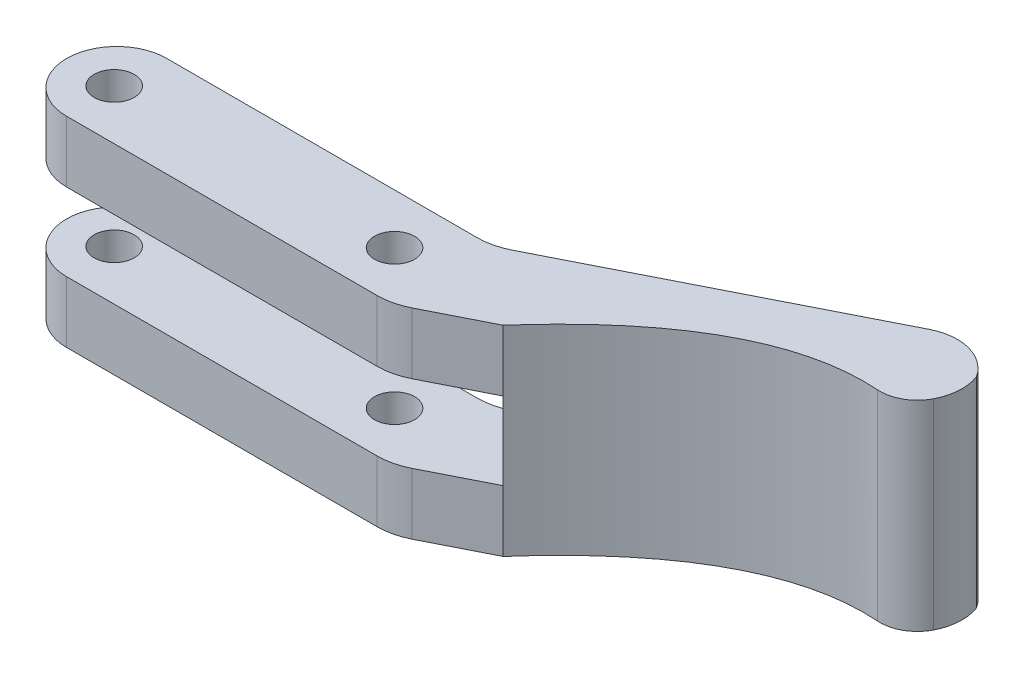
ISO-10303-21;
HEADER;
FILE_DESCRIPTION(('STEP AP214'),'2;1');
FILE_NAME('part.step','',(''),(''),'','','');
FILE_SCHEMA(('AUTOMOTIVE_DESIGN { 1 0 10303 214 1 1 1 1 }'));
ENDSEC;
DATA;
#1=APPLICATION_CONTEXT('core data for automotive mechanical design processes');
#2=APPLICATION_PROTOCOL_DEFINITION('international standard','automotive_design',2000,#1);
#3=PRODUCT_CONTEXT('',#1,'mechanical');
#4=PRODUCT('Part','Part','',(#3));
#5=PRODUCT_RELATED_PRODUCT_CATEGORY('part','',(#4));
#6=PRODUCT_DEFINITION_FORMATION('','',#4);
#7=PRODUCT_DEFINITION_CONTEXT('part definition',#1,'design');
#8=PRODUCT_DEFINITION('design','',#6,#7);
#9=PRODUCT_DEFINITION_SHAPE('','',#8);
#10=(LENGTH_UNIT() NAMED_UNIT(*) SI_UNIT(.MILLI.,.METRE.));
#11=(NAMED_UNIT(*) PLANE_ANGLE_UNIT() SI_UNIT($,.RADIAN.));
#12=(NAMED_UNIT(*) SI_UNIT($,.STERADIAN.) SOLID_ANGLE_UNIT());
#13=UNCERTAINTY_MEASURE_WITH_UNIT(LENGTH_MEASURE(1.E-05),#10,'distance_accuracy_value','');
#14=(GEOMETRIC_REPRESENTATION_CONTEXT(3) GLOBAL_UNCERTAINTY_ASSIGNED_CONTEXT((#13)) GLOBAL_UNIT_ASSIGNED_CONTEXT((#10,
#11,#12)) REPRESENTATION_CONTEXT('',''));
#15=CARTESIAN_POINT('',(0.,0.,0.));
#16=DIRECTION('',(0.,0.,1.));
#17=DIRECTION('',(1.,0.,0.));
#18=AXIS2_PLACEMENT_3D('',#15,#16,#17);
#19=CARTESIAN_POINT('',(44.9986813592081,-36.9202167830774,-11.1468532007413));
#20=DIRECTION('',(0.450721748209073,0.,0.892664497832952));
#21=DIRECTION('',(0.892664497832953,0.,-0.450721748209073));
#22=AXIS2_PLACEMENT_3D('',#19,#20,#21);
#23=PLANE('',#22);
#24=DIRECTION('',(0.892664497832952,0.,-0.450721748209073));
#25=VECTOR('',#24,1.);
#26=CARTESIAN_POINT('',(44.9986813592081,5.,-11.1468532007413));
#27=LINE('',#26,#25);
#28=CARTESIAN_POINT('',(16.0629018071827,5.,3.46332248916476));
#29=VERTEX_POINT('',#28);
#30=CARTESIAN_POINT('',(20.8967399177184,5.,1.02263400090364));
#31=VERTEX_POINT('',#30);
#32=EDGE_CURVE('E215',#29,#31,#27,.T.);
#33=ORIENTED_EDGE('',*,*,#32,.F.);
#34=DIRECTION('',(0.,-1.,0.));
#35=VECTOR('',#34,1.);
#36=CARTESIAN_POINT('',(16.0629018071827,0.100000000000003,3.46332248916476));
#37=LINE('',#36,#35);
#38=CARTESIAN_POINT('',(16.0629018071827,0.100000000000003,3.46332248916476));
#39=VERTEX_POINT('',#38);
#40=EDGE_CURVE('E303',#29,#39,#37,.T.);
#41=ORIENTED_EDGE('',*,*,#40,.T.);
#42=DIRECTION('',(-0.892664497832953,0.,0.450721748209073));
#43=VECTOR('',#42,1.);
#44=CARTESIAN_POINT('',(44.9986813592081,0.100000000000003,-11.1468532007413));
#45=LINE('',#44,#43);
#46=CARTESIAN_POINT('',(20.8967399177184,0.0999999999999994,1.02263400090364));
#47=VERTEX_POINT('',#46);
#48=EDGE_CURVE('E238',#47,#39,#45,.T.);
#49=ORIENTED_EDGE('',*,*,#48,.F.);
#50=DIRECTION('',(0.,1.,0.));
#51=VECTOR('',#50,1.);
#52=CARTESIAN_POINT('',(20.8967399177184,-11.,1.02263400090364));
#53=LINE('',#52,#51);
#54=EDGE_CURVE('E195',#47,#31,#53,.T.);
#55=ORIENTED_EDGE('',*,*,#54,.T.);
#56=EDGE_LOOP('',(#33,#41,#49,#55));
#57=FACE_BOUND('',#56,.T.);
#58=ADVANCED_FACE('F40',(#57),#23,.T.);
#59=CARTESIAN_POINT('',(-15.,5.,-4.));
#60=DIRECTION('',(0.,0.,1.));
#61=DIRECTION('',(1.,0.,0.));
#62=AXIS2_PLACEMENT_3D('',#59,#60,#61);
#63=PLANE('',#62);
#64=DIRECTION('',(-1.,0.,0.));
#65=VECTOR('',#64,1.);
#66=CARTESIAN_POINT('',(15.,-6.1,-4.));
#67=LINE('',#66,#65);
#68=CARTESIAN_POINT('',(13.8092930661374,-6.1,-4.));
#69=VERTEX_POINT('',#68);
#70=CARTESIAN_POINT('',(-11.,-6.1,-4.));
#71=VERTEX_POINT('',#70);
#72=EDGE_CURVE('E384',#69,#71,#67,.T.);
#73=ORIENTED_EDGE('',*,*,#72,.F.);
#74=DIRECTION('',(0.,-1.,0.));
#75=VECTOR('',#74,1.);
#76=CARTESIAN_POINT('',(13.8092930661374,5.,-4.));
#77=LINE('',#76,#75);
#78=CARTESIAN_POINT('',(13.8092930661374,-11.,-4.));
#79=VERTEX_POINT('',#78);
#80=EDGE_CURVE('E312',#69,#79,#77,.T.);
#81=ORIENTED_EDGE('',*,*,#80,.T.);
#82=DIRECTION('',(1.,0.,0.));
#83=VECTOR('',#82,1.);
#84=CARTESIAN_POINT('',(-15.,-11.,-4.));
#85=LINE('',#84,#83);
#86=CARTESIAN_POINT('',(-11.,-11.,-4.));
#87=VERTEX_POINT('',#86);
#88=EDGE_CURVE('E217',#87,#79,#85,.T.);
#89=ORIENTED_EDGE('',*,*,#88,.F.);
#90=DIRECTION('',(0.,-1.,0.));
#91=VECTOR('',#90,1.);
#92=CARTESIAN_POINT('',(-11.,5.,-4.));
#93=LINE('',#92,#91);
#94=EDGE_CURVE('E245',#87,#71,#93,.F.);
#95=ORIENTED_EDGE('',*,*,#94,.T.);
#96=EDGE_LOOP('',(#73,#81,#89,#95));
#97=FACE_BOUND('',#96,.T.);
#98=ADVANCED_FACE('F413',(#97),#63,.F.);
#99=CARTESIAN_POINT('',(-15.,5.,4.));
#100=DIRECTION('',(0.,0.,-1.));
#101=DIRECTION('',(-1.,0.,0.));
#102=AXIS2_PLACEMENT_3D('',#99,#100,#101);
#103=PLANE('',#102);
#104=DIRECTION('',(-1.,0.,0.));
#105=VECTOR('',#104,1.);
#106=CARTESIAN_POINT('',(15.,-11.,4.));
#107=LINE('',#106,#105);
#108=CARTESIAN_POINT('',(13.8092930661374,-11.,4.));
#109=VERTEX_POINT('',#108);
#110=CARTESIAN_POINT('',(-11.,-11.,4.));
#111=VERTEX_POINT('',#110);
#112=EDGE_CURVE('E212',#109,#111,#107,.T.);
#113=ORIENTED_EDGE('',*,*,#112,.F.);
#114=DIRECTION('',(0.,-1.,0.));
#115=VECTOR('',#114,1.);
#116=CARTESIAN_POINT('',(13.8092930661374,-6.1,4.));
#117=LINE('',#116,#115);
#118=CARTESIAN_POINT('',(13.8092930661374,-6.1,4.));
#119=VERTEX_POINT('',#118);
#120=EDGE_CURVE('E299',#109,#119,#117,.F.);
#121=ORIENTED_EDGE('',*,*,#120,.T.);
#122=DIRECTION('',(1.,0.,0.));
#123=VECTOR('',#122,1.);
#124=CARTESIAN_POINT('',(-15.,-6.1,4.));
#125=LINE('',#124,#123);
#126=CARTESIAN_POINT('',(-11.,-6.1,4.));
#127=VERTEX_POINT('',#126);
#128=EDGE_CURVE('E273',#127,#119,#125,.T.);
#129=ORIENTED_EDGE('',*,*,#128,.F.);
#130=DIRECTION('',(0.,-1.,0.));
#131=VECTOR('',#130,1.);
#132=CARTESIAN_POINT('',(-11.,5.,4.));
#133=LINE('',#132,#131);
#134=EDGE_CURVE('E264',#127,#111,#133,.T.);
#135=ORIENTED_EDGE('',*,*,#134,.T.);
#136=EDGE_LOOP('',(#113,#121,#129,#135));
#137=FACE_BOUND('',#136,.T.);
#138=ADVANCED_FACE('F429',(#137),#103,.F.);
#139=CARTESIAN_POINT('',(-11.2,5.,0.));
#140=DIRECTION('',(0.,-1.,0.));
#141=DIRECTION('',(0.,0.,-1.));
#142=AXIS2_PLACEMENT_3D('',#139,#140,#141);
#143=CYLINDRICAL_SURFACE('',#142,1.6);
#144=CARTESIAN_POINT('',(-11.2,-11.,0.));
#145=DIRECTION('',(0.,-1.,0.));
#146=DIRECTION('',(0.,0.,-1.));
#147=AXIS2_PLACEMENT_3D('',#144,#145,#146);
#148=CIRCLE('',#147,1.6);
#149=CARTESIAN_POINT('',(-11.2,-11.,-1.6));
#150=VERTEX_POINT('',#149);
#151=EDGE_CURVE('E405',#150,#150,#148,.T.);
#152=ORIENTED_EDGE('',*,*,#151,.T.);
#153=EDGE_LOOP('',(#152));
#154=FACE_BOUND('',#153,.T.);
#155=CARTESIAN_POINT('',(-11.2,-6.1,0.));
#156=DIRECTION('',(0.,1.,0.));
#157=DIRECTION('',(0.,0.,1.));
#158=AXIS2_PLACEMENT_3D('',#155,#156,#157);
#159=CIRCLE('',#158,1.6);
#160=CARTESIAN_POINT('',(-11.2,-6.1,1.6));
#161=VERTEX_POINT('',#160);
#162=EDGE_CURVE('E393',#161,#161,#159,.T.);
#163=ORIENTED_EDGE('',*,*,#162,.T.);
#164=EDGE_LOOP('',(#163));
#165=FACE_BOUND('',#164,.T.);
#166=ADVANCED_FACE('F460',(#154,#165),#143,.F.);
#167=CARTESIAN_POINT('',(11.2,5.,0.));
#168=DIRECTION('',(0.,-1.,0.));
#169=DIRECTION('',(0.,0.,-1.));
#170=AXIS2_PLACEMENT_3D('',#167,#168,#169);
#171=CYLINDRICAL_SURFACE('',#170,1.6);
#172=CARTESIAN_POINT('',(11.2,-11.,0.));
#173=DIRECTION('',(0.,-1.,0.));
#174=DIRECTION('',(0.,0.,-1.));
#175=AXIS2_PLACEMENT_3D('',#172,#173,#174);
#176=CIRCLE('',#175,1.6);
#177=CARTESIAN_POINT('',(11.2,-11.,-1.6));
#178=VERTEX_POINT('',#177);
#179=EDGE_CURVE('E402',#178,#178,#176,.T.);
#180=ORIENTED_EDGE('',*,*,#179,.T.);
#181=EDGE_LOOP('',(#180));
#182=FACE_BOUND('',#181,.T.);
#183=CARTESIAN_POINT('',(11.2,-6.1,0.));
#184=DIRECTION('',(0.,1.,0.));
#185=DIRECTION('',(0.,0.,1.));
#186=AXIS2_PLACEMENT_3D('',#183,#184,#185);
#187=CIRCLE('',#186,1.6);
#188=CARTESIAN_POINT('',(11.2,-6.1,1.6));
#189=VERTEX_POINT('',#188);
#190=EDGE_CURVE('E390',#189,#189,#187,.T.);
#191=ORIENTED_EDGE('',*,*,#190,.T.);
#192=EDGE_LOOP('',(#191));
#193=FACE_BOUND('',#192,.T.);
#194=ADVANCED_FACE('F454',(#182,#193),#171,.F.);
#195=DIRECTION('',(-0.892664497832953,0.,0.450721748209073));
#196=VECTOR('',#195,1.);
#197=CARTESIAN_POINT('',(44.9986813592081,-6.1,-11.1468532007413));
#198=LINE('',#197,#196);
#199=CARTESIAN_POINT('',(20.8967399177184,-6.1,1.02263400090364));
#200=VERTEX_POINT('',#199);
#201=CARTESIAN_POINT('',(16.0629018071827,-6.1,3.46332248916476));
#202=VERTEX_POINT('',#201);
#203=EDGE_CURVE('E235',#200,#202,#198,.T.);
#204=ORIENTED_EDGE('',*,*,#203,.T.);
#205=DIRECTION('',(0.,-1.,0.));
#206=VECTOR('',#205,1.);
#207=CARTESIAN_POINT('',(16.0629018071827,-11.,3.46332248916476));
#208=LINE('',#207,#206);
#209=CARTESIAN_POINT('',(16.0629018071827,-11.,3.46332248916476));
#210=VERTEX_POINT('',#209);
#211=EDGE_CURVE('E211',#202,#210,#208,.T.);
#212=ORIENTED_EDGE('',*,*,#211,.T.);
#213=DIRECTION('',(-0.892664497832952,0.,0.450721748209073));
#214=VECTOR('',#213,1.);
#215=CARTESIAN_POINT('',(44.9986813592081,-11.,-11.1468532007413));
#216=LINE('',#215,#214);
#217=CARTESIAN_POINT('',(20.8967399177184,-11.,1.02263400090364));
#218=VERTEX_POINT('',#217);
#219=EDGE_CURVE('E188',#218,#210,#216,.T.);
#220=ORIENTED_EDGE('',*,*,#219,.F.);
#221=EDGE_CURVE('E199',#218,#200,#53,.T.);
#222=ORIENTED_EDGE('',*,*,#221,.T.);
#223=EDGE_LOOP('',(#204,#212,#220,#222));
#224=FACE_BOUND('',#223,.T.);
#225=ADVANCED_FACE('F209',(#224),#23,.T.);
#226=CARTESIAN_POINT('',(0.,5.,0.));
#227=DIRECTION('',(0.,1.,0.));
#228=DIRECTION('',(0.,0.,1.));
#229=AXIS2_PLACEMENT_3D('',#226,#227,#228);
#230=PLANE('',#229);
#231=DIRECTION('',(1.,0.,0.));
#232=VECTOR('',#231,1.);
#233=CARTESIAN_POINT('',(-15.,5.,4.));
#234=LINE('',#233,#232);
#235=CARTESIAN_POINT('',(-11.,5.,4.));
#236=VERTEX_POINT('',#235);
#237=CARTESIAN_POINT('',(13.8092930661374,5.,4.));
#238=VERTEX_POINT('',#237);
#239=EDGE_CURVE('E232',#236,#238,#234,.T.);
#240=ORIENTED_EDGE('',*,*,#239,.T.);
#241=CARTESIAN_POINT('',(13.8092930661374,5.,-1.));
#242=DIRECTION('',(0.,1.,0.));
#243=DIRECTION('',(0.,0.,1.));
#244=AXIS2_PLACEMENT_3D('',#241,#242,#243);
#245=CIRCLE('',#244,5.);
#246=EDGE_CURVE('E310',#238,#29,#245,.T.);
#247=ORIENTED_EDGE('',*,*,#246,.T.);
#248=ORIENTED_EDGE('',*,*,#32,.T.);
#249=CARTESIAN_POINT('',(41.4280233678763,5.,-9.34396620790504));
#250=CARTESIAN_POINT('',(33.095529517582,5.,-10.5510575615572));
#251=CARTESIAN_POINT('',(25.9801917787933,5.,-4.72849771955411));
#252=CARTESIAN_POINT('',(20.8967399177184,5.,1.02263400090364));
#253=B_SPLINE_CURVE_WITH_KNOTS('',3,(#249,#250,#251,#252),.UNSPECIFIED.,.F.,.F.,(4,4),(0.,1.),.UNSPECIFIED.);
#254=CARTESIAN_POINT('',(40.3021023320297,5.,-9.46547210052889));
#255=VERTEX_POINT('',#254);
#256=EDGE_CURVE('E196',#255,#31,#253,.T.);
#257=ORIENTED_EDGE('',*,*,#256,.F.);
#258=CARTESIAN_POINT('',(40.5147578351128,5.,-12.4579255482885));
#259=DIRECTION('',(0.,1.,0.));
#260=DIRECTION('',(0.,0.,1.));
#261=AXIS2_PLACEMENT_3D('',#258,#259,#260);
#262=CIRCLE('',#261,3.);
#263=CARTESIAN_POINT('',(43.183622215331,5.,-11.0878295954436));
#264=VERTEX_POINT('',#263);
#265=EDGE_CURVE('E291',#255,#264,#262,.T.);
#266=ORIENTED_EDGE('',*,*,#265,.T.);
#267=CARTESIAN_POINT('',(39.62513637504,5.,-12.9146241992368));
#268=DIRECTION('',(0.,1.,0.));
#269=DIRECTION('',(0.,0.,1.));
#270=AXIS2_PLACEMENT_3D('',#267,#268,#269);
#271=CIRCLE('',#270,4.);
#272=CARTESIAN_POINT('',(43.3686799463437,5.,-14.3238372880742));
#273=VERTEX_POINT('',#272);
#274=EDGE_CURVE('E269',#264,#273,#271,.T.);
#275=ORIENTED_EDGE('',*,*,#274,.T.);
#276=CARTESIAN_POINT('',(40.0121639364931,5.,-12.1481074621041));
#277=DIRECTION('',(0.,1.,0.));
#278=DIRECTION('',(0.,0.,1.));
#279=AXIS2_PLACEMENT_3D('',#276,#277,#278);
#280=CIRCLE('',#279,4.);
#281=CARTESIAN_POINT('',(38.2092769436568,5.,-15.7187654534359));
#282=VERTEX_POINT('',#281);
#283=EDGE_CURVE('E278',#273,#282,#280,.T.);
#284=ORIENTED_EDGE('',*,*,#283,.T.);
#285=DIRECTION('',(-0.892664497832952,0.,0.450721748209073));
#286=VECTOR('',#285,1.);
#287=CARTESIAN_POINT('',(15.,5.,-4.));
#288=LINE('',#287,#286);
#289=CARTESIAN_POINT('',(16.0629018071827,5.,-4.53667751083524));
#290=VERTEX_POINT('',#289);
#291=EDGE_CURVE('E222',#282,#290,#288,.T.);
#292=ORIENTED_EDGE('',*,*,#291,.T.);
#293=CARTESIAN_POINT('',(13.8092930661374,5.,-9.));
#294=DIRECTION('',(0.,1.,0.));
#295=DIRECTION('',(0.,0.,1.));
#296=AXIS2_PLACEMENT_3D('',#293,#294,#295);
#297=CIRCLE('',#296,5.);
#298=CARTESIAN_POINT('',(13.8092930661374,5.,-4.));
#299=VERTEX_POINT('',#298);
#300=EDGE_CURVE('E11',#290,#299,#297,.F.);
#301=ORIENTED_EDGE('',*,*,#300,.T.);
#302=DIRECTION('',(-1.,0.,0.));
#303=VECTOR('',#302,1.);
#304=CARTESIAN_POINT('',(-15.,5.,-4.));
#305=LINE('',#304,#303);
#306=CARTESIAN_POINT('',(-11.,5.,-4.));
#307=VERTEX_POINT('',#306);
#308=EDGE_CURVE('E230',#299,#307,#305,.T.);
#309=ORIENTED_EDGE('',*,*,#308,.T.);
#310=CARTESIAN_POINT('',(-11.,5.,0.));
#311=DIRECTION('',(0.,1.,0.));
#312=DIRECTION('',(0.,0.,1.));
#313=AXIS2_PLACEMENT_3D('',#310,#311,#312);
#314=CIRCLE('',#313,4.);
#315=CARTESIAN_POINT('',(-15.,5.,0.));
#316=VERTEX_POINT('',#315);
#317=EDGE_CURVE('E262',#307,#316,#314,.T.);
#318=ORIENTED_EDGE('',*,*,#317,.T.);
#319=CARTESIAN_POINT('',(-11.,5.,0.));
#320=DIRECTION('',(0.,1.,0.));
#321=DIRECTION('',(0.,0.,1.));
#322=AXIS2_PLACEMENT_3D('',#319,#320,#321);
#323=CIRCLE('',#322,4.);
#324=EDGE_CURVE('E260',#316,#236,#323,.T.);
#325=ORIENTED_EDGE('',*,*,#324,.T.);
#326=EDGE_LOOP('',(#240,#247,#248,#257,#266,#275,#284,#292,#301,#309,#318,#325));
#327=FACE_BOUND('',#326,.T.);
#328=CARTESIAN_POINT('',(-11.2,5.,0.));
#329=DIRECTION('',(0.,1.,0.));
#330=DIRECTION('',(0.,0.,1.));
#331=AXIS2_PLACEMENT_3D('',#328,#329,#330);
#332=CIRCLE('',#331,1.6);
#333=CARTESIAN_POINT('',(-11.2,5.,1.6));
#334=VERTEX_POINT('',#333);
#335=EDGE_CURVE('E227',#334,#334,#332,.T.);
#336=ORIENTED_EDGE('',*,*,#335,.F.);
#337=EDGE_LOOP('',(#336));
#338=FACE_BOUND('',#337,.T.);
#339=CARTESIAN_POINT('',(11.2,5.,0.));
#340=DIRECTION('',(0.,1.,0.));
#341=DIRECTION('',(0.,0.,-1.));
#342=AXIS2_PLACEMENT_3D('',#339,#340,#341);
#343=CIRCLE('',#342,1.6);
#344=CARTESIAN_POINT('',(11.2,5.,-1.6));
#345=VERTEX_POINT('',#344);
#346=EDGE_CURVE('E224',#345,#345,#343,.T.);
#347=ORIENTED_EDGE('',*,*,#346,.F.);
#348=EDGE_LOOP('',(#347));
#349=FACE_BOUND('',#348,.T.);
#350=ADVANCED_FACE('F345',(#327,#338,#349),#230,.T.);
#351=ORIENTED_EDGE('',*,*,#308,.F.);
#352=DIRECTION('',(0.,-1.,0.));
#353=VECTOR('',#352,1.);
#354=CARTESIAN_POINT('',(13.8092930661374,5.,-4.));
#355=LINE('',#354,#353);
#356=CARTESIAN_POINT('',(13.8092930661374,0.1,-4.));
#357=VERTEX_POINT('',#356);
#358=EDGE_CURVE('E318',#299,#357,#355,.T.);
#359=ORIENTED_EDGE('',*,*,#358,.T.);
#360=DIRECTION('',(-1.,0.,0.));
#361=VECTOR('',#360,1.);
#362=CARTESIAN_POINT('',(15.,0.1,-4.));
#363=LINE('',#362,#361);
#364=CARTESIAN_POINT('',(-11.,0.1,-4.));
#365=VERTEX_POINT('',#364);
#366=EDGE_CURVE('E331',#357,#365,#363,.T.);
#367=ORIENTED_EDGE('',*,*,#366,.T.);
#368=DIRECTION('',(0.,-1.,0.));
#369=VECTOR('',#368,1.);
#370=CARTESIAN_POINT('',(-11.,5.,-4.));
#371=LINE('',#370,#369);
#372=EDGE_CURVE('E257',#365,#307,#371,.F.);
#373=ORIENTED_EDGE('',*,*,#372,.T.);
#374=EDGE_LOOP('',(#351,#359,#367,#373));
#375=FACE_BOUND('',#374,.T.);
#376=ADVANCED_FACE('F342',(#375),#63,.F.);
#377=DIRECTION('',(1.,0.,0.));
#378=VECTOR('',#377,1.);
#379=CARTESIAN_POINT('',(-15.,0.1,4.));
#380=LINE('',#379,#378);
#381=CARTESIAN_POINT('',(-11.,0.1,4.));
#382=VERTEX_POINT('',#381);
#383=CARTESIAN_POINT('',(13.8092930661374,0.1,4.));
#384=VERTEX_POINT('',#383);
#385=EDGE_CURVE('E363',#382,#384,#380,.T.);
#386=ORIENTED_EDGE('',*,*,#385,.T.);
#387=DIRECTION('',(0.,-1.,0.));
#388=VECTOR('',#387,1.);
#389=CARTESIAN_POINT('',(13.8092930661374,5.,4.));
#390=LINE('',#389,#388);
#391=EDGE_CURVE('E308',#384,#238,#390,.F.);
#392=ORIENTED_EDGE('',*,*,#391,.T.);
#393=ORIENTED_EDGE('',*,*,#239,.F.);
#394=DIRECTION('',(0.,-1.,0.));
#395=VECTOR('',#394,1.);
#396=CARTESIAN_POINT('',(-11.,5.,4.));
#397=LINE('',#396,#395);
#398=EDGE_CURVE('E267',#236,#382,#397,.T.);
#399=ORIENTED_EDGE('',*,*,#398,.T.);
#400=EDGE_LOOP('',(#386,#392,#393,#399));
#401=FACE_BOUND('',#400,.T.);
#402=ADVANCED_FACE('F360',(#401),#103,.F.);
#403=CARTESIAN_POINT('',(-11.2,0.1,0.));
#404=DIRECTION('',(0.,1.,0.));
#405=DIRECTION('',(0.,0.,1.));
#406=AXIS2_PLACEMENT_3D('',#403,#404,#405);
#407=CIRCLE('',#406,1.6);
#408=CARTESIAN_POINT('',(-11.2,0.1,1.6));
#409=VERTEX_POINT('',#408);
#410=EDGE_CURVE('E399',#409,#409,#407,.T.);
#411=ORIENTED_EDGE('',*,*,#410,.F.);
#412=EDGE_LOOP('',(#411));
#413=FACE_BOUND('',#412,.T.);
#414=ORIENTED_EDGE('',*,*,#335,.T.);
#415=EDGE_LOOP('',(#414));
#416=FACE_BOUND('',#415,.T.);
#417=ADVANCED_FACE('F468',(#413,#416),#143,.F.);
#418=CARTESIAN_POINT('',(11.2,0.1,0.));
#419=DIRECTION('',(0.,1.,0.));
#420=DIRECTION('',(0.,0.,1.));
#421=AXIS2_PLACEMENT_3D('',#418,#419,#420);
#422=CIRCLE('',#421,1.6);
#423=CARTESIAN_POINT('',(11.2,0.1,1.6));
#424=VERTEX_POINT('',#423);
#425=EDGE_CURVE('E396',#424,#424,#422,.T.);
#426=ORIENTED_EDGE('',*,*,#425,.F.);
#427=EDGE_LOOP('',(#426));
#428=FACE_BOUND('',#427,.T.);
#429=ORIENTED_EDGE('',*,*,#346,.T.);
#430=EDGE_LOOP('',(#429));
#431=FACE_BOUND('',#430,.T.);
#432=ADVANCED_FACE('F462',(#428,#431),#171,.F.);
#433=CARTESIAN_POINT('',(15.,-36.9202167830774,-4.));
#434=DIRECTION('',(-0.450721748209073,0.,-0.892664497832953));
#435=DIRECTION('',(-0.892664497832953,0.,0.450721748209073));
#436=AXIS2_PLACEMENT_3D('',#433,#434,#435);
#437=PLANE('',#436);
#438=DIRECTION('',(0.892664497832952,0.,-0.450721748209073));
#439=VECTOR('',#438,1.);
#440=CARTESIAN_POINT('',(15.,-11.,-4.));
#441=LINE('',#440,#439);
#442=CARTESIAN_POINT('',(16.0629018071827,-11.,-4.53667751083524));
#443=VERTEX_POINT('',#442);
#444=CARTESIAN_POINT('',(38.2092769436568,-11.,-15.7187654534359));
#445=VERTEX_POINT('',#444);
#446=EDGE_CURVE('E213',#443,#445,#441,.T.);
#447=ORIENTED_EDGE('',*,*,#446,.F.);
#448=DIRECTION('',(0.,-1.,0.));
#449=VECTOR('',#448,1.);
#450=CARTESIAN_POINT('',(16.0629018071827,-36.9202167830774,-4.53667751083524));
#451=LINE('',#450,#449);
#452=CARTESIAN_POINT('',(16.0629018071827,-6.1,-4.53667751083524));
#453=VERTEX_POINT('',#452);
#454=EDGE_CURVE('E316',#443,#453,#451,.F.);
#455=ORIENTED_EDGE('',*,*,#454,.T.);
#456=DIRECTION('',(-0.892664497832952,0.,0.450721748209073));
#457=VECTOR('',#456,1.);
#458=CARTESIAN_POINT('',(17.6779934934989,-6.1,-5.35216524462722));
#459=LINE('',#458,#457);
#460=CARTESIAN_POINT('',(17.6779934934989,-6.1,-5.35216524462722));
#461=VERTEX_POINT('',#460);
#462=EDGE_CURVE('E381',#461,#453,#459,.T.);
#463=ORIENTED_EDGE('',*,*,#462,.F.);
#464=DIRECTION('',(0.,-1.,0.));
#465=VECTOR('',#464,1.);
#466=CARTESIAN_POINT('',(17.6779934934989,0.1,-5.35216524462722));
#467=LINE('',#466,#465);
#468=CARTESIAN_POINT('',(17.6779934934989,0.1,-5.35216524462722));
#469=VERTEX_POINT('',#468);
#470=EDGE_CURVE('E338',#469,#461,#467,.T.);
#471=ORIENTED_EDGE('',*,*,#470,.F.);
#472=DIRECTION('',(-0.892664497832952,0.,0.450721748209073));
#473=VECTOR('',#472,1.);
#474=CARTESIAN_POINT('',(17.6779934934989,0.1,-5.35216524462722));
#475=LINE('',#474,#473);
#476=CARTESIAN_POINT('',(16.0629018071827,0.1,-4.53667751083524));
#477=VERTEX_POINT('',#476);
#478=EDGE_CURVE('E329',#469,#477,#475,.T.);
#479=ORIENTED_EDGE('',*,*,#478,.T.);
#480=DIRECTION('',(0.,-1.,0.));
#481=VECTOR('',#480,1.);
#482=CARTESIAN_POINT('',(16.0629018071827,-36.9202167830774,-4.53667751083524));
#483=LINE('',#482,#481);
#484=EDGE_CURVE('E61',#477,#290,#483,.F.);
#485=ORIENTED_EDGE('',*,*,#484,.T.);
#486=ORIENTED_EDGE('',*,*,#291,.F.);
#487=DIRECTION('',(0.,1.,0.));
#488=VECTOR('',#487,1.);
#489=CARTESIAN_POINT('',(38.2092769436568,-36.9202167830774,-15.7187654534359));
#490=LINE('',#489,#488);
#491=EDGE_CURVE('E280',#282,#445,#490,.F.);
#492=ORIENTED_EDGE('',*,*,#491,.T.);
#493=EDGE_LOOP('',(#447,#455,#463,#471,#479,#485,#486,#492));
#494=FACE_BOUND('',#493,.T.);
#495=ADVANCED_FACE('F335',(#494),#437,.T.);
#496=CARTESIAN_POINT('',(0.,-11.,0.));
#497=DIRECTION('',(0.,-1.,0.));
#498=DIRECTION('',(0.,0.,-1.));
#499=AXIS2_PLACEMENT_3D('',#496,#497,#498);
#500=PLANE('',#499);
#501=ORIENTED_EDGE('',*,*,#219,.T.);
#502=CARTESIAN_POINT('',(13.8092930661374,-11.,-1.));
#503=DIRECTION('',(0.,-1.,0.));
#504=DIRECTION('',(0.,0.,-1.));
#505=AXIS2_PLACEMENT_3D('',#502,#503,#504);
#506=CIRCLE('',#505,5.);
#507=EDGE_CURVE('E297',#210,#109,#506,.T.);
#508=ORIENTED_EDGE('',*,*,#507,.T.);
#509=ORIENTED_EDGE('',*,*,#112,.T.);
#510=CARTESIAN_POINT('',(-11.,-11.,0.));
#511=DIRECTION('',(0.,-1.,0.));
#512=DIRECTION('',(0.,0.,-1.));
#513=AXIS2_PLACEMENT_3D('',#510,#511,#512);
#514=CIRCLE('',#513,4.);
#515=CARTESIAN_POINT('',(-15.,-11.,0.));
#516=VERTEX_POINT('',#515);
#517=EDGE_CURVE('E241',#111,#516,#514,.T.);
#518=ORIENTED_EDGE('',*,*,#517,.T.);
#519=CARTESIAN_POINT('',(-11.,-11.,0.));
#520=DIRECTION('',(0.,-1.,0.));
#521=DIRECTION('',(0.,0.,-1.));
#522=AXIS2_PLACEMENT_3D('',#519,#520,#521);
#523=CIRCLE('',#522,4.);
#524=EDGE_CURVE('E243',#516,#87,#523,.T.);
#525=ORIENTED_EDGE('',*,*,#524,.T.);
#526=ORIENTED_EDGE('',*,*,#88,.T.);
#527=CARTESIAN_POINT('',(13.8092930661374,-11.,-9.));
#528=DIRECTION('',(0.,-1.,0.));
#529=DIRECTION('',(0.,0.,-1.));
#530=AXIS2_PLACEMENT_3D('',#527,#528,#529);
#531=CIRCLE('',#530,5.);
#532=EDGE_CURVE('E321',#79,#443,#531,.F.);
#533=ORIENTED_EDGE('',*,*,#532,.T.);
#534=ORIENTED_EDGE('',*,*,#446,.T.);
#535=CARTESIAN_POINT('',(40.0121639364931,-11.,-12.1481074621041));
#536=DIRECTION('',(0.,-1.,0.));
#537=DIRECTION('',(0.,0.,-1.));
#538=AXIS2_PLACEMENT_3D('',#535,#536,#537);
#539=CIRCLE('',#538,4.);
#540=CARTESIAN_POINT('',(43.3686799463437,-11.,-14.3238372880742));
#541=VERTEX_POINT('',#540);
#542=EDGE_CURVE('E285',#445,#541,#539,.T.);
#543=ORIENTED_EDGE('',*,*,#542,.T.);
#544=CARTESIAN_POINT('',(39.62513637504,-11.,-12.9146241992368));
#545=DIRECTION('',(0.,-1.,0.));
#546=DIRECTION('',(0.,0.,-1.));
#547=AXIS2_PLACEMENT_3D('',#544,#545,#546);
#548=CIRCLE('',#547,4.);
#549=CARTESIAN_POINT('',(43.183622215331,-11.,-11.0878295954436));
#550=VERTEX_POINT('',#549);
#551=EDGE_CURVE('E283',#541,#550,#548,.T.);
#552=ORIENTED_EDGE('',*,*,#551,.T.);
#553=CARTESIAN_POINT('',(40.5147578351128,-11.,-12.4579255482885));
#554=DIRECTION('',(0.,-1.,0.));
#555=DIRECTION('',(0.,0.,-1.));
#556=AXIS2_PLACEMENT_3D('',#553,#554,#555);
#557=CIRCLE('',#556,3.);
#558=CARTESIAN_POINT('',(40.3021023320297,-11.,-9.46547210052889));
#559=VERTEX_POINT('',#558);
#560=EDGE_CURVE('E191',#550,#559,#557,.T.);
#561=ORIENTED_EDGE('',*,*,#560,.T.);
#562=CARTESIAN_POINT('',(41.4280233678763,-11.,-9.34396620790504));
#563=CARTESIAN_POINT('',(33.095529517582,-11.,-10.5510575615572));
#564=CARTESIAN_POINT('',(25.9801917787933,-11.,-4.72849771955411));
#565=CARTESIAN_POINT('',(20.8967399177184,-11.,1.02263400090364));
#566=B_SPLINE_CURVE_WITH_KNOTS('',3,(#562,#563,#564,#565),.UNSPECIFIED.,.F.,.F.,(4,4),(0.,1.),.UNSPECIFIED.);
#567=EDGE_CURVE('E183',#559,#218,#566,.T.);
#568=ORIENTED_EDGE('',*,*,#567,.T.);
#569=EDGE_LOOP('',(#501,#508,#509,#518,#525,#526,#533,#534,#543,#552,#561,#568));
#570=FACE_BOUND('',#569,.T.);
#571=ORIENTED_EDGE('',*,*,#151,.F.);
#572=EDGE_LOOP('',(#571));
#573=FACE_BOUND('',#572,.T.);
#574=ORIENTED_EDGE('',*,*,#179,.F.);
#575=EDGE_LOOP('',(#574));
#576=FACE_BOUND('',#575,.T.);
#577=ADVANCED_FACE('F185',(#570,#573,#576),#500,.T.);
#578=CARTESIAN_POINT('',(17.6779934934989,0.1,-5.35216524462722));
#579=DIRECTION('',(-0.892664497832952,0.,0.450721748209073));
#580=DIRECTION('',(0.450721748209073,0.,0.892664497832953));
#581=AXIS2_PLACEMENT_3D('',#578,#579,#580);
#582=PLANE('',#581);
#583=DIRECTION('',(-0.450721748209073,0.,-0.892664497832952));
#584=VECTOR('',#583,1.);
#585=CARTESIAN_POINT('',(17.6779934934989,0.1,-5.35216524462722));
#586=LINE('',#585,#584);
#587=EDGE_CURVE('E339',#47,#469,#586,.T.);
#588=ORIENTED_EDGE('',*,*,#587,.T.);
#589=ORIENTED_EDGE('',*,*,#470,.T.);
#590=DIRECTION('',(-0.450721748209073,0.,-0.892664497832952));
#591=VECTOR('',#590,1.);
#592=CARTESIAN_POINT('',(17.6779934934989,-6.1,-5.35216524462722));
#593=LINE('',#592,#591);
#594=EDGE_CURVE('E379',#200,#461,#593,.T.);
#595=ORIENTED_EDGE('',*,*,#594,.F.);
#596=DIRECTION('',(0.,-1.,0.));
#597=VECTOR('',#596,1.);
#598=CARTESIAN_POINT('',(20.8967399177184,-36.9202167830774,1.02263400090364));
#599=LINE('',#598,#597);
#600=EDGE_CURVE('E202',#47,#200,#599,.T.);
#601=ORIENTED_EDGE('',*,*,#600,.F.);
#602=EDGE_LOOP('',(#588,#589,#595,#601));
#603=FACE_BOUND('',#602,.T.);
#604=ADVANCED_FACE('F483',(#603),#582,.T.);
#605=CARTESIAN_POINT('',(0.,0.1,0.));
#606=DIRECTION('',(0.,1.,0.));
#607=DIRECTION('',(0.,0.,1.));
#608=AXIS2_PLACEMENT_3D('',#605,#606,#607);
#609=PLANE('',#608);
#610=ORIENTED_EDGE('',*,*,#410,.T.);
#611=EDGE_LOOP('',(#610));
#612=FACE_BOUND('',#611,.T.);
#613=ORIENTED_EDGE('',*,*,#425,.T.);
#614=EDGE_LOOP('',(#613));
#615=FACE_BOUND('',#614,.T.);
#616=ORIENTED_EDGE('',*,*,#48,.T.);
#617=CARTESIAN_POINT('',(13.8092930661374,0.100000000000003,-1.));
#618=DIRECTION('',(0.,1.,0.));
#619=DIRECTION('',(0.,0.,1.));
#620=AXIS2_PLACEMENT_3D('',#617,#618,#619);
#621=CIRCLE('',#620,5.);
#622=EDGE_CURVE('E306',#39,#384,#621,.F.);
#623=ORIENTED_EDGE('',*,*,#622,.T.);
#624=ORIENTED_EDGE('',*,*,#385,.F.);
#625=CARTESIAN_POINT('',(-11.,0.1,0.));
#626=DIRECTION('',(0.,1.,0.));
#627=DIRECTION('',(0.,0.,1.));
#628=AXIS2_PLACEMENT_3D('',#625,#626,#627);
#629=CIRCLE('',#628,4.);
#630=CARTESIAN_POINT('',(-15.,0.1,0.));
#631=VERTEX_POINT('',#630);
#632=EDGE_CURVE('E252',#382,#631,#629,.F.);
#633=ORIENTED_EDGE('',*,*,#632,.T.);
#634=CARTESIAN_POINT('',(-11.,0.1,0.));
#635=DIRECTION('',(0.,1.,0.));
#636=DIRECTION('',(0.,0.,1.));
#637=AXIS2_PLACEMENT_3D('',#634,#635,#636);
#638=CIRCLE('',#637,4.);
#639=EDGE_CURVE('E254',#631,#365,#638,.F.);
#640=ORIENTED_EDGE('',*,*,#639,.T.);
#641=ORIENTED_EDGE('',*,*,#366,.F.);
#642=CARTESIAN_POINT('',(13.8092930661374,0.1,-9.));
#643=DIRECTION('',(0.,1.,0.));
#644=DIRECTION('',(0.,0.,1.));
#645=AXIS2_PLACEMENT_3D('',#642,#643,#644);
#646=CIRCLE('',#645,5.);
#647=EDGE_CURVE('E48',#357,#477,#646,.T.);
#648=ORIENTED_EDGE('',*,*,#647,.T.);
#649=ORIENTED_EDGE('',*,*,#478,.F.);
#650=ORIENTED_EDGE('',*,*,#587,.F.);
#651=EDGE_LOOP('',(#616,#623,#624,#633,#640,#641,#648,#649,#650));
#652=FACE_BOUND('',#651,.T.);
#653=ADVANCED_FACE('F327',(#612,#615,#652),#609,.F.);
#654=CARTESIAN_POINT('',(0.,-6.1,0.));
#655=DIRECTION('',(0.,1.,0.));
#656=DIRECTION('',(0.,0.,1.));
#657=AXIS2_PLACEMENT_3D('',#654,#655,#656);
#658=PLANE('',#657);
#659=ORIENTED_EDGE('',*,*,#162,.F.);
#660=EDGE_LOOP('',(#659));
#661=FACE_BOUND('',#660,.T.);
#662=ORIENTED_EDGE('',*,*,#190,.F.);
#663=EDGE_LOOP('',(#662));
#664=FACE_BOUND('',#663,.T.);
#665=ORIENTED_EDGE('',*,*,#128,.T.);
#666=CARTESIAN_POINT('',(13.8092930661374,-6.1,-1.));
#667=DIRECTION('',(0.,1.,0.));
#668=DIRECTION('',(0.,0.,1.));
#669=AXIS2_PLACEMENT_3D('',#666,#667,#668);
#670=CIRCLE('',#669,5.);
#671=EDGE_CURVE('E301',#119,#202,#670,.T.);
#672=ORIENTED_EDGE('',*,*,#671,.T.);
#673=ORIENTED_EDGE('',*,*,#203,.F.);
#674=ORIENTED_EDGE('',*,*,#594,.T.);
#675=ORIENTED_EDGE('',*,*,#462,.T.);
#676=CARTESIAN_POINT('',(13.8092930661374,-6.1,-9.));
#677=DIRECTION('',(0.,1.,0.));
#678=DIRECTION('',(0.,0.,1.));
#679=AXIS2_PLACEMENT_3D('',#676,#677,#678);
#680=CIRCLE('',#679,5.);
#681=EDGE_CURVE('E323',#453,#69,#680,.F.);
#682=ORIENTED_EDGE('',*,*,#681,.T.);
#683=ORIENTED_EDGE('',*,*,#72,.T.);
#684=CARTESIAN_POINT('',(-11.,-6.1,0.));
#685=DIRECTION('',(0.,1.,0.));
#686=DIRECTION('',(0.,0.,1.));
#687=AXIS2_PLACEMENT_3D('',#684,#685,#686);
#688=CIRCLE('',#687,4.);
#689=CARTESIAN_POINT('',(-15.,-6.1,0.));
#690=VERTEX_POINT('',#689);
#691=EDGE_CURVE('E250',#71,#690,#688,.T.);
#692=ORIENTED_EDGE('',*,*,#691,.T.);
#693=CARTESIAN_POINT('',(-11.,-6.1,0.));
#694=DIRECTION('',(0.,1.,0.));
#695=DIRECTION('',(0.,0.,1.));
#696=AXIS2_PLACEMENT_3D('',#693,#694,#695);
#697=CIRCLE('',#696,4.);
#698=EDGE_CURVE('E248',#690,#127,#697,.T.);
#699=ORIENTED_EDGE('',*,*,#698,.T.);
#700=EDGE_LOOP('',(#665,#672,#673,#674,#675,#682,#683,#692,#699));
#701=FACE_BOUND('',#700,.T.);
#702=ADVANCED_FACE('F421',(#661,#664,#701),#658,.T.);
#703=CARTESIAN_POINT('',(-11.,5.,0.));
#704=DIRECTION('',(0.,-1.,0.));
#705=DIRECTION('',(0.,0.,-1.));
#706=AXIS2_PLACEMENT_3D('',#703,#704,#705);
#707=CYLINDRICAL_SURFACE('',#706,4.);
#708=ORIENTED_EDGE('',*,*,#134,.F.);
#709=ORIENTED_EDGE('',*,*,#698,.F.);
#710=DIRECTION('',(0.,-1.,0.));
#711=VECTOR('',#710,1.);
#712=CARTESIAN_POINT('',(-15.,5.,0.));
#713=LINE('',#712,#711);
#714=EDGE_CURVE('E270',#516,#690,#713,.F.);
#715=ORIENTED_EDGE('',*,*,#714,.F.);
#716=ORIENTED_EDGE('',*,*,#517,.F.);
#717=EDGE_LOOP('',(#708,#709,#715,#716));
#718=FACE_BOUND('',#717,.T.);
#719=ADVANCED_FACE('F425',(#718),#707,.T.);
#720=CARTESIAN_POINT('',(-11.,5.,0.));
#721=DIRECTION('',(0.,-1.,0.));
#722=DIRECTION('',(0.,0.,-1.));
#723=AXIS2_PLACEMENT_3D('',#720,#721,#722);
#724=CYLINDRICAL_SURFACE('',#723,4.);
#725=ORIENTED_EDGE('',*,*,#691,.F.);
#726=ORIENTED_EDGE('',*,*,#94,.F.);
#727=ORIENTED_EDGE('',*,*,#524,.F.);
#728=ORIENTED_EDGE('',*,*,#714,.T.);
#729=EDGE_LOOP('',(#725,#726,#727,#728));
#730=FACE_BOUND('',#729,.T.);
#731=ADVANCED_FACE('F417',(#730),#724,.T.);
#732=CARTESIAN_POINT('',(-11.,5.,0.));
#733=DIRECTION('',(0.,-1.,0.));
#734=DIRECTION('',(0.,0.,-1.));
#735=AXIS2_PLACEMENT_3D('',#732,#733,#734);
#736=CYLINDRICAL_SURFACE('',#735,4.);
#737=ORIENTED_EDGE('',*,*,#398,.F.);
#738=ORIENTED_EDGE('',*,*,#324,.F.);
#739=DIRECTION('',(0.,-1.,0.));
#740=VECTOR('',#739,1.);
#741=CARTESIAN_POINT('',(-15.,5.,0.));
#742=LINE('',#741,#740);
#743=EDGE_CURVE('E274',#631,#316,#742,.F.);
#744=ORIENTED_EDGE('',*,*,#743,.F.);
#745=ORIENTED_EDGE('',*,*,#632,.F.);
#746=EDGE_LOOP('',(#737,#738,#744,#745));
#747=FACE_BOUND('',#746,.T.);
#748=ADVANCED_FACE('F355',(#747),#736,.T.);
#749=CARTESIAN_POINT('',(-11.,5.,0.));
#750=DIRECTION('',(0.,-1.,0.));
#751=DIRECTION('',(0.,0.,-1.));
#752=AXIS2_PLACEMENT_3D('',#749,#750,#751);
#753=CYLINDRICAL_SURFACE('',#752,4.);
#754=ORIENTED_EDGE('',*,*,#317,.F.);
#755=ORIENTED_EDGE('',*,*,#372,.F.);
#756=ORIENTED_EDGE('',*,*,#639,.F.);
#757=ORIENTED_EDGE('',*,*,#743,.T.);
#758=EDGE_LOOP('',(#754,#755,#756,#757));
#759=FACE_BOUND('',#758,.T.);
#760=ADVANCED_FACE('F349',(#759),#753,.T.);
#761=CARTESIAN_POINT('',(39.62513637504,-36.9202167830774,-12.9146241992368));
#762=DIRECTION('',(0.,1.,0.));
#763=DIRECTION('',(0.,0.,1.));
#764=AXIS2_PLACEMENT_3D('',#761,#762,#763);
#765=CYLINDRICAL_SURFACE('',#764,4.);
#766=ORIENTED_EDGE('',*,*,#274,.F.);
#767=DIRECTION('',(0.,1.,0.));
#768=VECTOR('',#767,1.);
#769=CARTESIAN_POINT('',(43.183622215331,-36.9202167830774,-11.0878295954436));
#770=LINE('',#769,#768);
#771=EDGE_CURVE('E293',#264,#550,#770,.F.);
#772=ORIENTED_EDGE('',*,*,#771,.T.);
#773=ORIENTED_EDGE('',*,*,#551,.F.);
#774=DIRECTION('',(0.,1.,0.));
#775=VECTOR('',#774,1.);
#776=CARTESIAN_POINT('',(43.3686799463437,-3.,-14.3238372880742));
#777=LINE('',#776,#775);
#778=EDGE_CURVE('E206',#273,#541,#777,.F.);
#779=ORIENTED_EDGE('',*,*,#778,.F.);
#780=EDGE_LOOP('',(#766,#772,#773,#779));
#781=FACE_BOUND('',#780,.T.);
#782=ADVANCED_FACE('F518',(#781),#765,.T.);
#783=CARTESIAN_POINT('',(40.0121639364931,-36.9202167830774,-12.1481074621041));
#784=DIRECTION('',(0.,1.,0.));
#785=DIRECTION('',(0.,0.,1.));
#786=AXIS2_PLACEMENT_3D('',#783,#784,#785);
#787=CYLINDRICAL_SURFACE('',#786,4.);
#788=ORIENTED_EDGE('',*,*,#542,.F.);
#789=ORIENTED_EDGE('',*,*,#491,.F.);
#790=ORIENTED_EDGE('',*,*,#283,.F.);
#791=ORIENTED_EDGE('',*,*,#778,.T.);
#792=EDGE_LOOP('',(#788,#789,#790,#791));
#793=FACE_BOUND('',#792,.T.);
#794=ADVANCED_FACE('F513',(#793),#787,.T.);
#795=DIRECTION('',(0.,1.,0.));
#796=VECTOR('',#795,1.);
#797=SURFACE_OF_LINEAR_EXTRUSION('',#566,#796);
#798=ORIENTED_EDGE('',*,*,#567,.F.);
#799=DIRECTION('',(0.,1.,0.));
#800=VECTOR('',#799,1.);
#801=CARTESIAN_POINT('',(40.3021023320297,-11.,-9.46547210052889));
#802=LINE('',#801,#800);
#803=EDGE_CURVE('E287',#559,#255,#802,.T.);
#804=ORIENTED_EDGE('',*,*,#803,.T.);
#805=ORIENTED_EDGE('',*,*,#256,.T.);
#806=ORIENTED_EDGE('',*,*,#54,.F.);
#807=ORIENTED_EDGE('',*,*,#600,.T.);
#808=ORIENTED_EDGE('',*,*,#221,.F.);
#809=EDGE_LOOP('',(#798,#804,#805,#806,#807,#808));
#810=FACE_BOUND('',#809,.T.);
#811=ADVANCED_FACE('F200',(#810),#797,.F.);
#812=CARTESIAN_POINT('',(40.5147578351128,-3.,-12.4579255482885));
#813=DIRECTION('',(0.,1.,0.));
#814=DIRECTION('',(0.,0.,1.));
#815=AXIS2_PLACEMENT_3D('',#812,#813,#814);
#816=CYLINDRICAL_SURFACE('',#815,3.);
#817=ORIENTED_EDGE('',*,*,#560,.F.);
#818=ORIENTED_EDGE('',*,*,#771,.F.);
#819=ORIENTED_EDGE('',*,*,#265,.F.);
#820=ORIENTED_EDGE('',*,*,#803,.F.);
#821=EDGE_LOOP('',(#817,#818,#819,#820));
#822=FACE_BOUND('',#821,.T.);
#823=ADVANCED_FACE('F435',(#822),#816,.T.);
#824=CARTESIAN_POINT('',(13.8092930661374,-36.9202167830774,-1.));
#825=DIRECTION('',(0.,1.,0.));
#826=DIRECTION('',(0.,0.,1.));
#827=AXIS2_PLACEMENT_3D('',#824,#825,#826);
#828=CYLINDRICAL_SURFACE('',#827,5.);
#829=ORIENTED_EDGE('',*,*,#671,.F.);
#830=ORIENTED_EDGE('',*,*,#120,.F.);
#831=ORIENTED_EDGE('',*,*,#507,.F.);
#832=ORIENTED_EDGE('',*,*,#211,.F.);
#833=EDGE_LOOP('',(#829,#830,#831,#832));
#834=FACE_BOUND('',#833,.T.);
#835=ADVANCED_FACE('F433',(#834),#828,.T.);
#836=CARTESIAN_POINT('',(13.8092930661374,-36.9202167830774,-1.));
#837=DIRECTION('',(0.,1.,0.));
#838=DIRECTION('',(0.,0.,1.));
#839=AXIS2_PLACEMENT_3D('',#836,#837,#838);
#840=CYLINDRICAL_SURFACE('',#839,5.);
#841=ORIENTED_EDGE('',*,*,#246,.F.);
#842=ORIENTED_EDGE('',*,*,#391,.F.);
#843=ORIENTED_EDGE('',*,*,#622,.F.);
#844=ORIENTED_EDGE('',*,*,#40,.F.);
#845=EDGE_LOOP('',(#841,#842,#843,#844));
#846=FACE_BOUND('',#845,.T.);
#847=ADVANCED_FACE('F365',(#846),#840,.T.);
#848=CARTESIAN_POINT('',(13.8092930661374,5.,-9.));
#849=DIRECTION('',(0.,-1.,0.));
#850=DIRECTION('',(0.,0.,-1.));
#851=AXIS2_PLACEMENT_3D('',#848,#849,#850);
#852=CYLINDRICAL_SURFACE('',#851,5.);
#853=ORIENTED_EDGE('',*,*,#681,.F.);
#854=ORIENTED_EDGE('',*,*,#454,.F.);
#855=ORIENTED_EDGE('',*,*,#532,.F.);
#856=ORIENTED_EDGE('',*,*,#80,.F.);
#857=EDGE_LOOP('',(#853,#854,#855,#856));
#858=FACE_BOUND('',#857,.T.);
#859=ADVANCED_FACE('F441',(#858),#852,.F.);
#860=CARTESIAN_POINT('',(13.8092930661374,5.,-9.));
#861=DIRECTION('',(0.,-1.,0.));
#862=DIRECTION('',(0.,0.,-1.));
#863=AXIS2_PLACEMENT_3D('',#860,#861,#862);
#864=CYLINDRICAL_SURFACE('',#863,5.);
#865=ORIENTED_EDGE('',*,*,#300,.F.);
#866=ORIENTED_EDGE('',*,*,#484,.F.);
#867=ORIENTED_EDGE('',*,*,#647,.F.);
#868=ORIENTED_EDGE('',*,*,#358,.F.);
#869=EDGE_LOOP('',(#865,#866,#867,#868));
#870=FACE_BOUND('',#869,.T.);
#871=ADVANCED_FACE('F42',(#870),#864,.F.);
#872=CLOSED_SHELL('',(#58,#98,#138,#166,#194,#225,#350,#376,#402,#417,#432,#495,#577,#604,#653,
#702,#719,#731,#748,#760,#782,#794,#811,#823,#835,#847,#859,#871));
#873=MANIFOLD_SOLID_BREP('B2',#872);
#874=ADVANCED_BREP_SHAPE_REPRESENTATION('',(#18,#873),#14);
#875=SHAPE_DEFINITION_REPRESENTATION(#9,#874);
ENDSEC;
END-ISO-10303-21;
